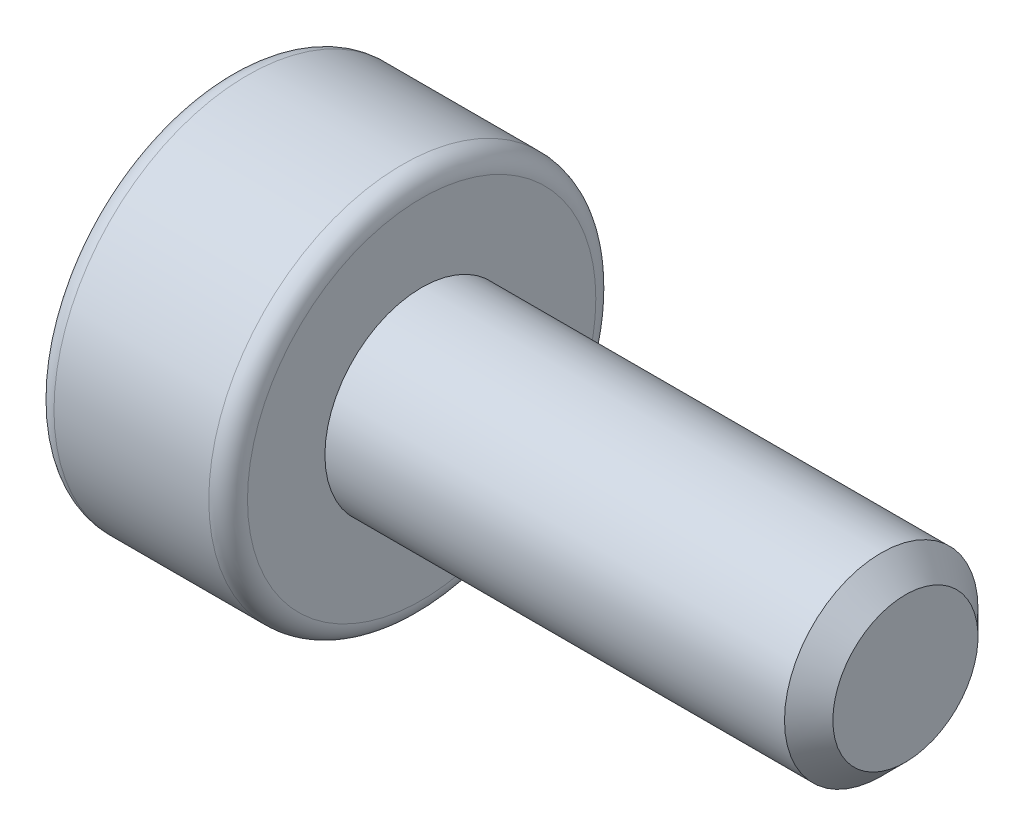
ISO-10303-21;
HEADER;
FILE_DESCRIPTION(('STEP AP214'),'2;1');
FILE_NAME('part.step','',(''),(''),'','','');
FILE_SCHEMA(('AUTOMOTIVE_DESIGN { 1 0 10303 214 1 1 1 1 }'));
ENDSEC;
DATA;
#1=APPLICATION_CONTEXT('core data for automotive mechanical design processes');
#2=APPLICATION_PROTOCOL_DEFINITION('international standard','automotive_design',2000,#1);
#3=PRODUCT_CONTEXT('',#1,'mechanical');
#4=PRODUCT('Part','Part','',(#3));
#5=PRODUCT_RELATED_PRODUCT_CATEGORY('part','',(#4));
#6=PRODUCT_DEFINITION_FORMATION('','',#4);
#7=PRODUCT_DEFINITION_CONTEXT('part definition',#1,'design');
#8=PRODUCT_DEFINITION('design','',#6,#7);
#9=PRODUCT_DEFINITION_SHAPE('','',#8);
#10=(LENGTH_UNIT() NAMED_UNIT(*) SI_UNIT(.MILLI.,.METRE.));
#11=(NAMED_UNIT(*) PLANE_ANGLE_UNIT() SI_UNIT($,.RADIAN.));
#12=(NAMED_UNIT(*) SI_UNIT($,.STERADIAN.) SOLID_ANGLE_UNIT());
#13=UNCERTAINTY_MEASURE_WITH_UNIT(LENGTH_MEASURE(1.E-05),#10,'distance_accuracy_value','');
#14=(GEOMETRIC_REPRESENTATION_CONTEXT(3) GLOBAL_UNCERTAINTY_ASSIGNED_CONTEXT((#13)) GLOBAL_UNIT_ASSIGNED_CONTEXT((#10,
#11,#12)) REPRESENTATION_CONTEXT('',''));
#15=CARTESIAN_POINT('',(0.,0.,0.));
#16=DIRECTION('',(0.,0.,1.));
#17=DIRECTION('',(1.,0.,0.));
#18=AXIS2_PLACEMENT_3D('',#15,#16,#17);
#19=CARTESIAN_POINT('',(0.,0.,0.));
#20=DIRECTION('',(1.,0.,0.));
#21=DIRECTION('',(0.,0.,-1.));
#22=AXIS2_PLACEMENT_3D('',#19,#20,#21);
#23=PLANE('',#22);
#24=DIRECTION('',(0.,0.866025403784439,0.5));
#25=VECTOR('',#24,1.);
#26=CARTESIAN_POINT('',(0.,-0.75,0.433012701892219));
#27=LINE('',#26,#25);
#28=CARTESIAN_POINT('',(0.,-0.75,0.433012701892219));
#29=VERTEX_POINT('',#28);
#30=CARTESIAN_POINT('',(0.,0.,0.866025403784438));
#31=VERTEX_POINT('',#30);
#32=EDGE_CURVE('E122',#29,#31,#27,.T.);
#33=ORIENTED_EDGE('',*,*,#32,.F.);
#34=DIRECTION('',(0.,0.,1.));
#35=VECTOR('',#34,1.);
#36=CARTESIAN_POINT('',(0.,-0.75,-0.43301270189222));
#37=LINE('',#36,#35);
#38=CARTESIAN_POINT('',(0.,-0.75,-0.43301270189222));
#39=VERTEX_POINT('',#38);
#40=EDGE_CURVE('E48',#39,#29,#37,.T.);
#41=ORIENTED_EDGE('',*,*,#40,.F.);
#42=DIRECTION('',(0.,-0.866025403784439,0.5));
#43=VECTOR('',#42,1.);
#44=CARTESIAN_POINT('',(0.,0.,-0.866025403784439));
#45=LINE('',#44,#43);
#46=CARTESIAN_POINT('',(0.,0.,-0.866025403784439));
#47=VERTEX_POINT('',#46);
#48=EDGE_CURVE('E131',#47,#39,#45,.T.);
#49=ORIENTED_EDGE('',*,*,#48,.F.);
#50=DIRECTION('',(0.,-0.866025403784439,-0.5));
#51=VECTOR('',#50,1.);
#52=CARTESIAN_POINT('',(0.,0.75,-0.43301270189222));
#53=LINE('',#52,#51);
#54=CARTESIAN_POINT('',(0.,0.75,-0.43301270189222));
#55=VERTEX_POINT('',#54);
#56=EDGE_CURVE('E129',#55,#47,#53,.T.);
#57=ORIENTED_EDGE('',*,*,#56,.F.);
#58=DIRECTION('',(0.,0.,-1.));
#59=VECTOR('',#58,1.);
#60=CARTESIAN_POINT('',(0.,0.75,0.433012701892219));
#61=LINE('',#60,#59);
#62=CARTESIAN_POINT('',(0.,0.75,0.433012701892219));
#63=VERTEX_POINT('',#62);
#64=EDGE_CURVE('E96',#63,#55,#61,.T.);
#65=ORIENTED_EDGE('',*,*,#64,.F.);
#66=DIRECTION('',(0.,0.866025403784439,-0.5));
#67=VECTOR('',#66,1.);
#68=CARTESIAN_POINT('',(0.,0.,0.866025403784438));
#69=LINE('',#68,#67);
#70=EDGE_CURVE('E125',#31,#63,#69,.T.);
#71=ORIENTED_EDGE('',*,*,#70,.F.);
#72=EDGE_LOOP('',(#33,#41,#49,#57,#65,#71));
#73=FACE_BOUND('',#72,.T.);
#74=CARTESIAN_POINT('',(0.,0.,0.));
#75=DIRECTION('',(-1.,0.,0.));
#76=DIRECTION('',(0.,0.,1.));
#77=AXIS2_PLACEMENT_3D('',#74,#75,#76);
#78=CIRCLE('',#77,1.8);
#79=CARTESIAN_POINT('',(0.,0.,1.8));
#80=VERTEX_POINT('',#79);
#81=EDGE_CURVE('E11',#80,#80,#78,.T.);
#82=ORIENTED_EDGE('',*,*,#81,.T.);
#83=EDGE_LOOP('',(#82));
#84=FACE_BOUND('',#83,.T.);
#85=ADVANCED_FACE('F34',(#73,#84),#23,.F.);
#86=CARTESIAN_POINT('',(0.2,0.,0.));
#87=DIRECTION('',(-1.,0.,0.));
#88=DIRECTION('',(0.,0.,1.));
#89=AXIS2_PLACEMENT_3D('',#86,#87,#88);
#90=TOROIDAL_SURFACE('',#89,1.8,0.2);
#91=ORIENTED_EDGE('',*,*,#81,.F.);
#92=EDGE_LOOP('',(#91));
#93=FACE_BOUND('',#92,.T.);
#94=CARTESIAN_POINT('',(0.200000000000001,0.,0.));
#95=DIRECTION('',(-1.,0.,0.));
#96=DIRECTION('',(0.,0.,1.));
#97=AXIS2_PLACEMENT_3D('',#94,#95,#96);
#98=CIRCLE('',#97,2.);
#99=CARTESIAN_POINT('',(0.200000000000001,0.,2.));
#100=VERTEX_POINT('',#99);
#101=EDGE_CURVE('E41',#100,#100,#98,.T.);
#102=ORIENTED_EDGE('',*,*,#101,.T.);
#103=EDGE_LOOP('',(#102));
#104=FACE_BOUND('',#103,.T.);
#105=ADVANCED_FACE('F157',(#93,#104),#90,.T.);
#106=CARTESIAN_POINT('',(-2.28184155946539,0.,0.));
#107=DIRECTION('',(-1.,0.,0.));
#108=DIRECTION('',(0.,0.,1.));
#109=AXIS2_PLACEMENT_3D('',#106,#107,#108);
#110=CYLINDRICAL_SURFACE('',#109,2.);
#111=ORIENTED_EDGE('',*,*,#101,.F.);
#112=EDGE_LOOP('',(#111));
#113=FACE_BOUND('',#112,.T.);
#114=CARTESIAN_POINT('',(1.8,0.,0.));
#115=DIRECTION('',(-1.,0.,0.));
#116=DIRECTION('',(0.,0.,1.));
#117=AXIS2_PLACEMENT_3D('',#114,#115,#116);
#118=CIRCLE('',#117,2.);
#119=CARTESIAN_POINT('',(1.8,0.,2.));
#120=VERTEX_POINT('',#119);
#121=EDGE_CURVE('E152',#120,#120,#118,.T.);
#122=ORIENTED_EDGE('',*,*,#121,.T.);
#123=EDGE_LOOP('',(#122));
#124=FACE_BOUND('',#123,.T.);
#125=ADVANCED_FACE('F159',(#113,#124),#110,.T.);
#126=CARTESIAN_POINT('',(1.8,0.,0.));
#127=DIRECTION('',(-1.,0.,0.));
#128=DIRECTION('',(0.,0.,1.));
#129=AXIS2_PLACEMENT_3D('',#126,#127,#128);
#130=TOROIDAL_SURFACE('',#129,1.8,0.2);
#131=ORIENTED_EDGE('',*,*,#121,.F.);
#132=EDGE_LOOP('',(#131));
#133=FACE_BOUND('',#132,.T.);
#134=CARTESIAN_POINT('',(2.,0.,0.));
#135=DIRECTION('',(-1.,0.,0.));
#136=DIRECTION('',(0.,0.,1.));
#137=AXIS2_PLACEMENT_3D('',#134,#135,#136);
#138=CIRCLE('',#137,1.8);
#139=CARTESIAN_POINT('',(2.,0.,1.8));
#140=VERTEX_POINT('',#139);
#141=EDGE_CURVE('E149',#140,#140,#138,.T.);
#142=ORIENTED_EDGE('',*,*,#141,.T.);
#143=EDGE_LOOP('',(#142));
#144=FACE_BOUND('',#143,.T.);
#145=ADVANCED_FACE('F162',(#133,#144),#130,.T.);
#146=CARTESIAN_POINT('',(2.,1.,0.));
#147=DIRECTION('',(-1.,0.,0.));
#148=DIRECTION('',(0.,0.,1.));
#149=AXIS2_PLACEMENT_3D('',#146,#147,#148);
#150=PLANE('',#149);
#151=ORIENTED_EDGE('',*,*,#141,.F.);
#152=EDGE_LOOP('',(#151));
#153=FACE_BOUND('',#152,.T.);
#154=CARTESIAN_POINT('',(2.,0.,0.));
#155=DIRECTION('',(-1.,0.,0.));
#156=DIRECTION('',(0.,0.,1.));
#157=AXIS2_PLACEMENT_3D('',#154,#155,#156);
#158=CIRCLE('',#157,1.);
#159=CARTESIAN_POINT('',(2.,0.,1.));
#160=VERTEX_POINT('',#159);
#161=EDGE_CURVE('E146',#160,#160,#158,.T.);
#162=ORIENTED_EDGE('',*,*,#161,.T.);
#163=EDGE_LOOP('',(#162));
#164=FACE_BOUND('',#163,.T.);
#165=ADVANCED_FACE('F168',(#153,#164),#150,.F.);
#166=CARTESIAN_POINT('',(-2.28184155946539,0.,0.));
#167=DIRECTION('',(-1.,0.,0.));
#168=DIRECTION('',(0.,0.,1.));
#169=AXIS2_PLACEMENT_3D('',#166,#167,#168);
#170=CYLINDRICAL_SURFACE('',#169,1.);
#171=ORIENTED_EDGE('',*,*,#161,.F.);
#172=EDGE_LOOP('',(#171));
#173=FACE_BOUND('',#172,.T.);
#174=CARTESIAN_POINT('',(6.75,0.,0.));
#175=DIRECTION('',(-1.,0.,0.));
#176=DIRECTION('',(0.,0.,1.));
#177=AXIS2_PLACEMENT_3D('',#174,#175,#176);
#178=CIRCLE('',#177,1.);
#179=CARTESIAN_POINT('',(6.75,0.,1.));
#180=VERTEX_POINT('',#179);
#181=EDGE_CURVE('E143',#180,#180,#178,.T.);
#182=ORIENTED_EDGE('',*,*,#181,.T.);
#183=EDGE_LOOP('',(#182));
#184=FACE_BOUND('',#183,.T.);
#185=ADVANCED_FACE('F174',(#173,#184),#170,.T.);
#186=CARTESIAN_POINT('',(7.,0.,0.));
#187=DIRECTION('',(-1.,0.,0.));
#188=DIRECTION('',(0.,0.,1.));
#189=AXIS2_PLACEMENT_3D('',#186,#187,#188);
#190=CONICAL_SURFACE('',#189,0.75,0.785398163397448);
#191=ORIENTED_EDGE('',*,*,#181,.F.);
#192=EDGE_LOOP('',(#191));
#193=FACE_BOUND('',#192,.T.);
#194=CARTESIAN_POINT('',(7.,0.,0.));
#195=DIRECTION('',(-1.,0.,0.));
#196=DIRECTION('',(0.,0.,1.));
#197=AXIS2_PLACEMENT_3D('',#194,#195,#196);
#198=CIRCLE('',#197,0.75);
#199=CARTESIAN_POINT('',(7.,0.,0.75));
#200=VERTEX_POINT('',#199);
#201=EDGE_CURVE('E135',#200,#200,#198,.T.);
#202=ORIENTED_EDGE('',*,*,#201,.T.);
#203=EDGE_LOOP('',(#202));
#204=FACE_BOUND('',#203,.T.);
#205=ADVANCED_FACE('F180',(#193,#204),#190,.T.);
#206=CARTESIAN_POINT('',(7.,0.75,0.));
#207=DIRECTION('',(-1.,0.,0.));
#208=DIRECTION('',(0.,0.,1.));
#209=AXIS2_PLACEMENT_3D('',#206,#207,#208);
#210=PLANE('',#209);
#211=ORIENTED_EDGE('',*,*,#201,.F.);
#212=EDGE_LOOP('',(#211));
#213=FACE_BOUND('',#212,.T.);
#214=ADVANCED_FACE('F186',(#213),#210,.F.);
#215=CARTESIAN_POINT('',(0.8,-0.75,-0.43301270189222));
#216=DIRECTION('',(0.,-1.,0.));
#217=DIRECTION('',(0.,0.,-1.));
#218=AXIS2_PLACEMENT_3D('',#215,#216,#217);
#219=PLANE('',#218);
#220=ORIENTED_EDGE('',*,*,#40,.T.);
#221=DIRECTION('',(-1.,0.,0.));
#222=VECTOR('',#221,1.);
#223=CARTESIAN_POINT('',(0.8,-0.75,0.433012701892219));
#224=LINE('',#223,#222);
#225=CARTESIAN_POINT('',(0.8,-0.75,0.433012701892219));
#226=VERTEX_POINT('',#225);
#227=EDGE_CURVE('E78',#226,#29,#224,.T.);
#228=ORIENTED_EDGE('',*,*,#227,.F.);
#229=DIRECTION('',(0.,0.,1.));
#230=VECTOR('',#229,1.);
#231=CARTESIAN_POINT('',(0.8,-0.75,-0.43301270189222));
#232=LINE('',#231,#230);
#233=CARTESIAN_POINT('',(0.8,-0.75,-0.43301270189222));
#234=VERTEX_POINT('',#233);
#235=EDGE_CURVE('E133',#234,#226,#232,.T.);
#236=ORIENTED_EDGE('',*,*,#235,.F.);
#237=DIRECTION('',(-1.,0.,0.));
#238=VECTOR('',#237,1.);
#239=CARTESIAN_POINT('',(0.8,-0.75,-0.43301270189222));
#240=LINE('',#239,#238);
#241=EDGE_CURVE('E56',#234,#39,#240,.T.);
#242=ORIENTED_EDGE('',*,*,#241,.T.);
#243=EDGE_LOOP('',(#220,#228,#236,#242));
#244=FACE_BOUND('',#243,.T.);
#245=ADVANCED_FACE('F191',(#244),#219,.F.);
#246=CARTESIAN_POINT('',(0.8,0.,-0.866025403784439));
#247=DIRECTION('',(0.,-0.5,-0.866025403784439));
#248=DIRECTION('',(0.,0.866025403784439,-0.5));
#249=AXIS2_PLACEMENT_3D('',#246,#247,#248);
#250=PLANE('',#249);
#251=ORIENTED_EDGE('',*,*,#48,.T.);
#252=ORIENTED_EDGE('',*,*,#241,.F.);
#253=DIRECTION('',(0.,-0.866025403784439,0.5));
#254=VECTOR('',#253,1.);
#255=CARTESIAN_POINT('',(0.8,0.,-0.866025403784439));
#256=LINE('',#255,#254);
#257=CARTESIAN_POINT('',(0.8,0.,-0.866025403784439));
#258=VERTEX_POINT('',#257);
#259=EDGE_CURVE('E108',#258,#234,#256,.T.);
#260=ORIENTED_EDGE('',*,*,#259,.F.);
#261=DIRECTION('',(-1.,0.,0.));
#262=VECTOR('',#261,1.);
#263=CARTESIAN_POINT('',(0.8,0.,-0.866025403784439));
#264=LINE('',#263,#262);
#265=EDGE_CURVE('E100',#258,#47,#264,.T.);
#266=ORIENTED_EDGE('',*,*,#265,.T.);
#267=EDGE_LOOP('',(#251,#252,#260,#266));
#268=FACE_BOUND('',#267,.T.);
#269=ADVANCED_FACE('F196',(#268),#250,.F.);
#270=CARTESIAN_POINT('',(0.8,0.75,-0.43301270189222));
#271=DIRECTION('',(0.,0.5,-0.866025403784439));
#272=DIRECTION('',(0.,0.866025403784439,0.5));
#273=AXIS2_PLACEMENT_3D('',#270,#271,#272);
#274=PLANE('',#273);
#275=ORIENTED_EDGE('',*,*,#56,.T.);
#276=ORIENTED_EDGE('',*,*,#265,.F.);
#277=DIRECTION('',(0.,-0.866025403784439,-0.5));
#278=VECTOR('',#277,1.);
#279=CARTESIAN_POINT('',(0.8,0.75,-0.43301270189222));
#280=LINE('',#279,#278);
#281=CARTESIAN_POINT('',(0.8,0.75,-0.43301270189222));
#282=VERTEX_POINT('',#281);
#283=EDGE_CURVE('E104',#282,#258,#280,.T.);
#284=ORIENTED_EDGE('',*,*,#283,.F.);
#285=DIRECTION('',(-1.,0.,0.));
#286=VECTOR('',#285,1.);
#287=CARTESIAN_POINT('',(0.8,0.75,-0.43301270189222));
#288=LINE('',#287,#286);
#289=EDGE_CURVE('E89',#282,#55,#288,.T.);
#290=ORIENTED_EDGE('',*,*,#289,.T.);
#291=EDGE_LOOP('',(#275,#276,#284,#290));
#292=FACE_BOUND('',#291,.T.);
#293=ADVANCED_FACE('F105',(#292),#274,.F.);
#294=CARTESIAN_POINT('',(0.8,0.75,0.433012701892219));
#295=DIRECTION('',(0.,1.,0.));
#296=DIRECTION('',(0.,0.,1.));
#297=AXIS2_PLACEMENT_3D('',#294,#295,#296);
#298=PLANE('',#297);
#299=ORIENTED_EDGE('',*,*,#64,.T.);
#300=ORIENTED_EDGE('',*,*,#289,.F.);
#301=DIRECTION('',(0.,0.,-1.));
#302=VECTOR('',#301,1.);
#303=CARTESIAN_POINT('',(0.8,0.75,0.433012701892219));
#304=LINE('',#303,#302);
#305=CARTESIAN_POINT('',(0.8,0.75,0.433012701892219));
#306=VERTEX_POINT('',#305);
#307=EDGE_CURVE('E93',#306,#282,#304,.T.);
#308=ORIENTED_EDGE('',*,*,#307,.F.);
#309=DIRECTION('',(-1.,0.,0.));
#310=VECTOR('',#309,1.);
#311=CARTESIAN_POINT('',(0.8,0.75,0.433012701892219));
#312=LINE('',#311,#310);
#313=EDGE_CURVE('E101',#306,#63,#312,.T.);
#314=ORIENTED_EDGE('',*,*,#313,.T.);
#315=EDGE_LOOP('',(#299,#300,#308,#314));
#316=FACE_BOUND('',#315,.T.);
#317=ADVANCED_FACE('F91',(#316),#298,.F.);
#318=CARTESIAN_POINT('',(0.8,0.,0.866025403784438));
#319=DIRECTION('',(0.,0.5,0.866025403784439));
#320=DIRECTION('',(0.,-0.866025403784439,0.5));
#321=AXIS2_PLACEMENT_3D('',#318,#319,#320);
#322=PLANE('',#321);
#323=ORIENTED_EDGE('',*,*,#70,.T.);
#324=ORIENTED_EDGE('',*,*,#313,.F.);
#325=DIRECTION('',(0.,0.866025403784439,-0.5));
#326=VECTOR('',#325,1.);
#327=CARTESIAN_POINT('',(0.8,0.,0.866025403784438));
#328=LINE('',#327,#326);
#329=CARTESIAN_POINT('',(0.8,0.,0.866025403784438));
#330=VERTEX_POINT('',#329);
#331=EDGE_CURVE('E114',#330,#306,#328,.T.);
#332=ORIENTED_EDGE('',*,*,#331,.F.);
#333=DIRECTION('',(-1.,0.,0.));
#334=VECTOR('',#333,1.);
#335=CARTESIAN_POINT('',(0.8,0.,0.866025403784438));
#336=LINE('',#335,#334);
#337=EDGE_CURVE('E138',#330,#31,#336,.T.);
#338=ORIENTED_EDGE('',*,*,#337,.T.);
#339=EDGE_LOOP('',(#323,#324,#332,#338));
#340=FACE_BOUND('',#339,.T.);
#341=ADVANCED_FACE('F222',(#340),#322,.F.);
#342=CARTESIAN_POINT('',(0.8,-0.75,0.433012701892219));
#343=DIRECTION('',(0.,-0.5,0.866025403784439));
#344=DIRECTION('',(0.,-0.866025403784439,-0.5));
#345=AXIS2_PLACEMENT_3D('',#342,#343,#344);
#346=PLANE('',#345);
#347=ORIENTED_EDGE('',*,*,#32,.T.);
#348=ORIENTED_EDGE('',*,*,#337,.F.);
#349=DIRECTION('',(0.,0.866025403784439,0.5));
#350=VECTOR('',#349,1.);
#351=CARTESIAN_POINT('',(0.8,-0.75,0.433012701892219));
#352=LINE('',#351,#350);
#353=EDGE_CURVE('E116',#226,#330,#352,.T.);
#354=ORIENTED_EDGE('',*,*,#353,.F.);
#355=ORIENTED_EDGE('',*,*,#227,.T.);
#356=EDGE_LOOP('',(#347,#348,#354,#355));
#357=FACE_BOUND('',#356,.T.);
#358=ADVANCED_FACE('F210',(#357),#346,.F.);
#359=CARTESIAN_POINT('',(0.8,0.,0.));
#360=DIRECTION('',(-1.,0.,0.));
#361=DIRECTION('',(0.,0.,1.));
#362=AXIS2_PLACEMENT_3D('',#359,#360,#361);
#363=PLANE('',#362);
#364=ORIENTED_EDGE('',*,*,#235,.T.);
#365=ORIENTED_EDGE('',*,*,#353,.T.);
#366=ORIENTED_EDGE('',*,*,#331,.T.);
#367=ORIENTED_EDGE('',*,*,#307,.T.);
#368=ORIENTED_EDGE('',*,*,#283,.T.);
#369=ORIENTED_EDGE('',*,*,#259,.T.);
#370=EDGE_LOOP('',(#364,#365,#366,#367,#368,#369));
#371=FACE_BOUND('',#370,.T.);
#372=ADVANCED_FACE('F111',(#371),#363,.T.);
#373=CLOSED_SHELL('',(#85,#105,#125,#145,#165,#185,#205,#214,#245,#269,#293,#317,#341,#358,#372));
#374=MANIFOLD_SOLID_BREP('B2',#373);
#375=ADVANCED_BREP_SHAPE_REPRESENTATION('',(#18,#374),#14);
#376=SHAPE_DEFINITION_REPRESENTATION(#9,#375);
ENDSEC;
END-ISO-10303-21;
